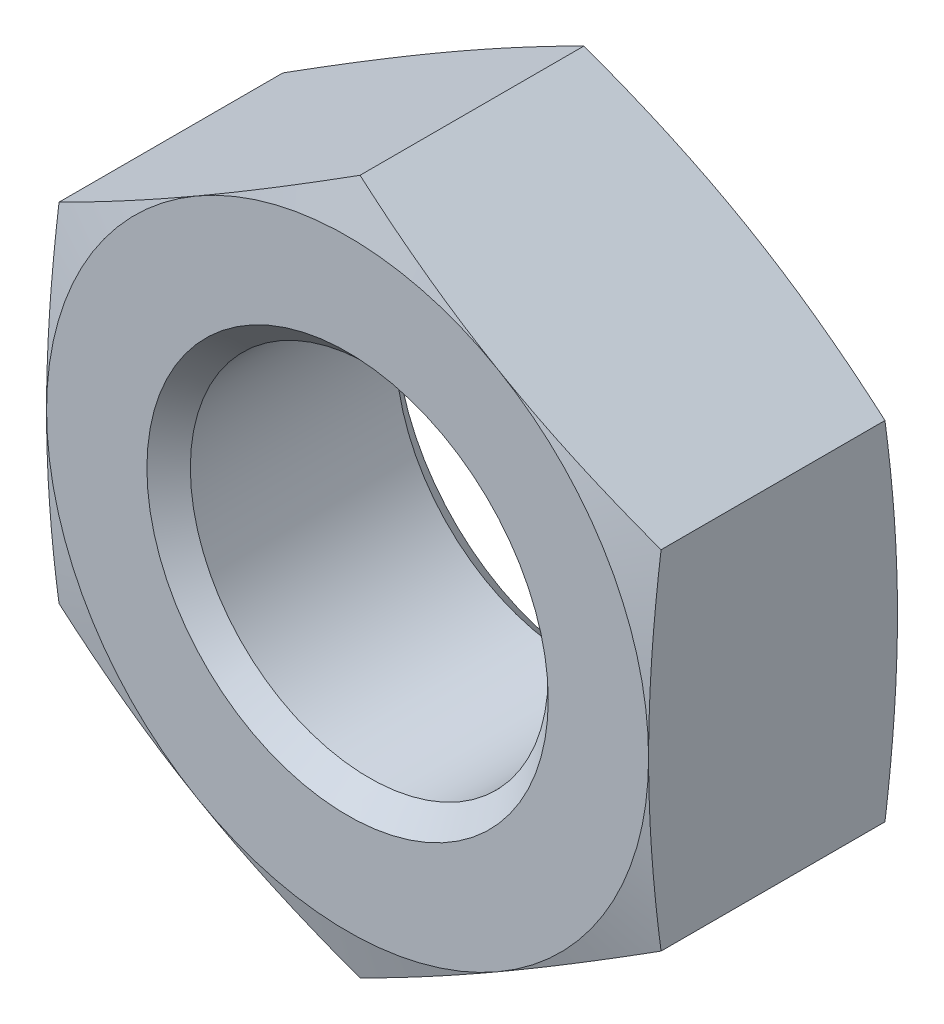
ISO-10303-21;
HEADER;
FILE_DESCRIPTION(('STEP AP214'),'2;1');
FILE_NAME('part.step','',(''),(''),'','','');
FILE_SCHEMA(('AUTOMOTIVE_DESIGN { 1 0 10303 214 1 1 1 1 }'));
ENDSEC;
DATA;
#1=APPLICATION_CONTEXT('core data for automotive mechanical design processes');
#2=APPLICATION_PROTOCOL_DEFINITION('international standard','automotive_design',2000,#1);
#3=PRODUCT_CONTEXT('',#1,'mechanical');
#4=PRODUCT('Part','Part','',(#3));
#5=PRODUCT_RELATED_PRODUCT_CATEGORY('part','',(#4));
#6=PRODUCT_DEFINITION_FORMATION('','',#4);
#7=PRODUCT_DEFINITION_CONTEXT('part definition',#1,'design');
#8=PRODUCT_DEFINITION('design','',#6,#7);
#9=PRODUCT_DEFINITION_SHAPE('','',#8);
#10=(LENGTH_UNIT() NAMED_UNIT(*) SI_UNIT(.MILLI.,.METRE.));
#11=(NAMED_UNIT(*) PLANE_ANGLE_UNIT() SI_UNIT($,.RADIAN.));
#12=(NAMED_UNIT(*) SI_UNIT($,.STERADIAN.) SOLID_ANGLE_UNIT());
#13=UNCERTAINTY_MEASURE_WITH_UNIT(LENGTH_MEASURE(1.E-05),#10,'distance_accuracy_value','');
#14=(GEOMETRIC_REPRESENTATION_CONTEXT(3) GLOBAL_UNCERTAINTY_ASSIGNED_CONTEXT((#13)) GLOBAL_UNIT_ASSIGNED_CONTEXT((#10,
#11,#12)) REPRESENTATION_CONTEXT('',''));
#15=CARTESIAN_POINT('',(0.,0.,0.));
#16=DIRECTION('',(0.,0.,1.));
#17=DIRECTION('',(1.,0.,0.));
#18=AXIS2_PLACEMENT_3D('',#15,#16,#17);
#19=CARTESIAN_POINT('',(0.,0.,0.));
#20=DIRECTION('',(0.,0.,-1.));
#21=DIRECTION('',(-1.,0.,0.));
#22=AXIS2_PLACEMENT_3D('',#19,#20,#21);
#23=PLANE('',#22);
#24=CARTESIAN_POINT('',(0.,0.,0.));
#25=DIRECTION('',(0.,0.,1.));
#26=DIRECTION('',(1.,0.,0.));
#27=AXIS2_PLACEMENT_3D('',#24,#25,#26);
#28=CIRCLE('',#27,9.525);
#29=CARTESIAN_POINT('',(9.525,0.,0.));
#30=VERTEX_POINT('',#29);
#31=CARTESIAN_POINT('',(4.76249999999967,8.24889197104679,0.));
#32=VERTEX_POINT('',#31);
#33=EDGE_CURVE('E11',#30,#32,#28,.T.);
#34=ORIENTED_EDGE('',*,*,#33,.T.);
#35=CARTESIAN_POINT('',(-4.76249999999967,8.24889197104679,0.));
#36=VERTEX_POINT('',#35);
#37=EDGE_CURVE('E43',#32,#36,#28,.T.);
#38=ORIENTED_EDGE('',*,*,#37,.T.);
#39=CARTESIAN_POINT('',(-9.525,0.,0.));
#40=VERTEX_POINT('',#39);
#41=EDGE_CURVE('E328',#36,#40,#28,.T.);
#42=ORIENTED_EDGE('',*,*,#41,.T.);
#43=CARTESIAN_POINT('',(-4.76249999999967,-8.24889197104679,0.));
#44=VERTEX_POINT('',#43);
#45=EDGE_CURVE('E321',#40,#44,#28,.T.);
#46=ORIENTED_EDGE('',*,*,#45,.T.);
#47=CARTESIAN_POINT('',(4.76249999999967,-8.24889197104679,0.));
#48=VERTEX_POINT('',#47);
#49=EDGE_CURVE('E324',#44,#48,#28,.T.);
#50=ORIENTED_EDGE('',*,*,#49,.T.);
#51=EDGE_CURVE('E44',#48,#30,#28,.T.);
#52=ORIENTED_EDGE('',*,*,#51,.T.);
#53=EDGE_LOOP('',(#34,#38,#42,#46,#50,#52));
#54=FACE_BOUND('',#53,.T.);
#55=CARTESIAN_POINT('',(0.,0.,0.));
#56=DIRECTION('',(0.,0.,1.));
#57=DIRECTION('',(1.,0.,0.));
#58=AXIS2_PLACEMENT_3D('',#55,#56,#57);
#59=CIRCLE('',#58,6.35);
#60=CARTESIAN_POINT('',(6.35,0.,0.));
#61=VERTEX_POINT('',#60);
#62=EDGE_CURVE('E185',#61,#61,#59,.T.);
#63=ORIENTED_EDGE('',*,*,#62,.F.);
#64=EDGE_LOOP('',(#63));
#65=FACE_BOUND('',#64,.T.);
#66=ADVANCED_FACE('F36',(#54,#65),#23,.F.);
#67=CARTESIAN_POINT('',(0.,9.525,-7.874));
#68=DIRECTION('',(0.,0.,1.));
#69=DIRECTION('',(1.,0.,0.));
#70=AXIS2_PLACEMENT_3D('',#67,#68,#69);
#71=PLANE('',#70);
#72=CARTESIAN_POINT('',(0.,0.,-7.874));
#73=DIRECTION('',(0.,0.,1.));
#74=DIRECTION('',(1.,0.,0.));
#75=AXIS2_PLACEMENT_3D('',#72,#73,#74);
#76=CIRCLE('',#75,9.525);
#77=CARTESIAN_POINT('',(9.525,0.,-7.874));
#78=VERTEX_POINT('',#77);
#79=CARTESIAN_POINT('',(4.76249999999967,8.24889197104679,-7.874));
#80=VERTEX_POINT('',#79);
#81=EDGE_CURVE('E359',#78,#80,#76,.T.);
#82=ORIENTED_EDGE('',*,*,#81,.F.);
#83=CARTESIAN_POINT('',(4.76249999999967,-8.24889197104679,-7.874));
#84=VERTEX_POINT('',#83);
#85=EDGE_CURVE('E362',#84,#78,#76,.T.);
#86=ORIENTED_EDGE('',*,*,#85,.F.);
#87=CARTESIAN_POINT('',(-4.76249999999967,-8.24889197104679,-7.874));
#88=VERTEX_POINT('',#87);
#89=EDGE_CURVE('E363',#88,#84,#76,.T.);
#90=ORIENTED_EDGE('',*,*,#89,.F.);
#91=CARTESIAN_POINT('',(-9.525,0.,-7.874));
#92=VERTEX_POINT('',#91);
#93=EDGE_CURVE('E143',#92,#88,#76,.T.);
#94=ORIENTED_EDGE('',*,*,#93,.F.);
#95=CARTESIAN_POINT('',(-4.76249999999967,8.24889197104679,-7.874));
#96=VERTEX_POINT('',#95);
#97=EDGE_CURVE('E360',#96,#92,#76,.T.);
#98=ORIENTED_EDGE('',*,*,#97,.F.);
#99=EDGE_CURVE('E356',#80,#96,#76,.T.);
#100=ORIENTED_EDGE('',*,*,#99,.F.);
#101=EDGE_LOOP('',(#82,#86,#90,#94,#98,#100));
#102=FACE_BOUND('',#101,.T.);
#103=CARTESIAN_POINT('',(0.,0.,-7.874));
#104=DIRECTION('',(0.,0.,1.));
#105=DIRECTION('',(1.,0.,0.));
#106=AXIS2_PLACEMENT_3D('',#103,#104,#105);
#107=CIRCLE('',#106,6.35);
#108=CARTESIAN_POINT('',(6.35,0.,-7.874));
#109=VERTEX_POINT('',#108);
#110=EDGE_CURVE('E205',#109,#109,#107,.T.);
#111=ORIENTED_EDGE('',*,*,#110,.T.);
#112=EDGE_LOOP('',(#111));
#113=FACE_BOUND('',#112,.T.);
#114=ADVANCED_FACE('F209',(#102,#113),#71,.F.);
#115=CARTESIAN_POINT('',(0.,0.,-0.51044321158129));
#116=DIRECTION('',(0.,0.,-1.));
#117=DIRECTION('',(-1.,0.,0.));
#118=AXIS2_PLACEMENT_3D('',#115,#116,#117);
#119=CONICAL_SURFACE('',#118,11.43,1.30899693899575);
#120=CARTESIAN_POINT('',(-9.5252,5.49914584397736,-0.394860138813217));
#121=CARTESIAN_POINT('',(-9.12963409059495,5.72752592825459,-0.333640796682183));
#122=CARTESIAN_POINT('',(-8.73335098645959,5.95632008510242,-0.278063785000044));
#123=CARTESIAN_POINT('',(-7.93938530731218,6.41471638368547,-0.180420245700739));
#124=CARTESIAN_POINT('',(-7.54170222999413,6.64431881542719,-0.138359205490608));
#125=CARTESIAN_POINT('',(-6.74734769859133,7.10293961796456,-0.0702030508394436));
#126=CARTESIAN_POINT('',(-6.35068161565081,7.33195488772865,-0.0440266592177038));
#127=CARTESIAN_POINT('',(-5.55684361330912,7.79027747207355,-0.00892680272709887));
#128=CARTESIAN_POINT('',(-5.15967180665456,8.01958472156008,0.));
#129=CARTESIAN_POINT('',(-4.36532819334544,8.47819922053312,0.));
#130=CARTESIAN_POINT('',(-3.96815638669089,8.70750647001964,-0.00892680272707922));
#131=CARTESIAN_POINT('',(-3.1743183843492,9.16582905436454,-0.0440266592176653));
#132=CARTESIAN_POINT('',(-2.77765230140867,9.39484432412863,-0.0702030508393962));
#133=CARTESIAN_POINT('',(-1.98329777000587,9.85346512666601,-0.138359205490543));
#134=CARTESIAN_POINT('',(-1.58561469268782,10.0830675584077,-0.180420245700665));
#135=CARTESIAN_POINT('',(-0.791649013540406,10.5414638569908,-0.278063784999956));
#136=CARTESIAN_POINT('',(-0.395365909405051,10.7702580138386,-0.333640796682088));
#137=CARTESIAN_POINT('',(0.000200000000002884,10.9986380981158,-0.394860138813116));
#138=B_SPLINE_CURVE_WITH_KNOTS('',3,(#120,#121,#122,#123,#124,#125,#126,#127,#128,#129,#130,
#131,#132,#133,#134,#135,#136,#137),.UNSPECIFIED.,.F.,.F.,(4,2,2,2,2,2,2,2,4),(0.,
1.38260595399383,2.76577253095806,4.14180081922071,5.51756281432405,6.89332480942739,
8.26935309769005,9.65251967465428,11.0351256286481),.UNSPECIFIED.);
#139=CARTESIAN_POINT('',(-9.525,5.4992613140312,-0.394829198218301));
#140=VERTEX_POINT('',#139);
#141=EDGE_CURVE('E336',#140,#36,#138,.T.);
#142=ORIENTED_EDGE('',*,*,#141,.F.);
#143=CARTESIAN_POINT('',(-9.525,-14.5475764020868,-2.10700053733457));
#144=CARTESIAN_POINT('',(-9.525,-14.1154545272533,-2.01015665380227));
#145=CARTESIAN_POINT('',(-9.525,-13.6830623737584,-1.91449717538181));
#146=CARTESIAN_POINT('',(-9.525,-12.8176047718722,-1.72618634166031));
#147=CARTESIAN_POINT('',(-9.525,-12.3845392952461,-1.63353511627697));
#148=CARTESIAN_POINT('',(-9.525,-11.5172143724825,-1.45179947328317));
#149=CARTESIAN_POINT('',(-9.525,-11.0829541718439,-1.36271864368223));
#150=CARTESIAN_POINT('',(-9.525,-10.2135298995259,-1.18908532307698));
#151=CARTESIAN_POINT('',(-9.525,-9.77836583550729,-1.10453279385442));
#152=CARTESIAN_POINT('',(-9.525,-8.91045271387352,-0.941687070782559));
#153=CARTESIAN_POINT('',(-9.525,-8.47771204984104,-0.863349361783966));
#154=CARTESIAN_POINT('',(-9.525,-7.61103920723077,-0.713511175498409));
#155=CARTESIAN_POINT('',(-9.525,-7.17710702423409,-0.642010723603448));
#156=CARTESIAN_POINT('',(-9.525,-6.3079835787254,-0.507460134682709));
#157=CARTESIAN_POINT('',(-9.525,-5.87279249560451,-0.444408848938874));
#158=CARTESIAN_POINT('',(-9.525,-5.00102546538243,-0.328613528609522));
#159=CARTESIAN_POINT('',(-9.525,-4.56444951698422,-0.275869503680421));
#160=CARTESIAN_POINT('',(-9.525,-3.68498736907801,-0.182182226479484));
#161=CARTESIAN_POINT('',(-9.525,-3.24208590614391,-0.141380128858051));
#162=CARTESIAN_POINT('',(-9.525,-2.3551695192014,-0.0743914625047044));
#163=CARTESIAN_POINT('',(-9.525,-1.91115462096316,-0.0482045585876714));
#164=CARTESIAN_POINT('',(-9.525,-1.02265544778738,-0.0119736055530143));
#165=CARTESIAN_POINT('',(-9.525,-0.578171478140084,-0.00192222051875414));
#166=CARTESIAN_POINT('',(-9.525,0.310860382292135,0.0014197158828076));
#167=CARTESIAN_POINT('',(-9.525,0.755408273021624,-0.00528971830137563));
#168=CARTESIAN_POINT('',(-9.525,1.64556100156032,-0.0350921058062273));
#169=CARTESIAN_POINT('',(-9.525,2.09116380788821,-0.05824452135586));
#170=CARTESIAN_POINT('',(-9.525,2.98132146724324,-0.119611293454157));
#171=CARTESIAN_POINT('',(-9.525,3.42587629685002,-0.157825983466163));
#172=CARTESIAN_POINT('',(-9.525,4.31393426073179,-0.247386972149112));
#173=CARTESIAN_POINT('',(-9.525,4.75743651730109,-0.298741840574358));
#174=CARTESIAN_POINT('',(-9.525,5.64301373388866,-0.412446238030744));
#175=CARTESIAN_POINT('',(-9.525,6.08508868942129,-0.474795801581269));
#176=CARTESIAN_POINT('',(-9.525,6.93863059078922,-0.60406870466817));
#177=CARTESIAN_POINT('',(-9.525,7.35018571786526,-0.670415694558651));
#178=CARTESIAN_POINT('',(-9.525,8.1722113347349,-0.809549374135356));
#179=CARTESIAN_POINT('',(-9.525,8.58268179462157,-0.88233623951543));
#180=CARTESIAN_POINT('',(-9.525,9.40269226744411,-1.03317413364716));
#181=CARTESIAN_POINT('',(-9.525,9.81223218249156,-1.11122569191772));
#182=CARTESIAN_POINT('',(-9.525,10.6304633616968,-1.2716227533516));
#183=CARTESIAN_POINT('',(-9.525,11.0391546334989,-1.35396821766051));
#184=CARTESIAN_POINT('',(-9.525,11.8559072643163,-1.52219707925344));
#185=CARTESIAN_POINT('',(-9.525,12.263968451238,-1.60808130975762));
#186=CARTESIAN_POINT('',(-9.525,13.0794697353503,-1.78275374718487));
#187=CARTESIAN_POINT('',(-9.525,13.4869098289146,-1.87154197099536));
#188=CARTESIAN_POINT('',(-9.525,14.7083824724732,-2.141478979871));
#189=CARTESIAN_POINT('',(-9.525,15.5216227029363,-2.32621164794026));
#190=CARTESIAN_POINT('',(-9.525,17.1385663316362,-2.70049505968895));
#191=CARTESIAN_POINT('',(-9.525,17.9422849173435,-2.88998062119992));
#192=CARTESIAN_POINT('',(-9.525,19.5486013702555,-3.27370003667641));
#193=CARTESIAN_POINT('',(-9.525,20.3511992167613,-3.46793397714473));
#194=CARTESIAN_POINT('',(-9.525,21.9545467971208,-3.85966403393681));
#195=CARTESIAN_POINT('',(-9.525,22.7552975893812,-4.05715582886057));
#196=CARTESIAN_POINT('',(-9.525,24.3561016695518,-4.45483612957746));
#197=CARTESIAN_POINT('',(-9.525,25.1561549796084,-4.65502454616131));
#198=CARTESIAN_POINT('',(-9.525,25.9559652614663,-4.85616849306163));
#199=B_SPLINE_CURVE_WITH_KNOTS('',3,(#143,#144,#145,#146,#147,#148,#149,#150,#151,#152,#153,
#154,#155,#156,#157,#158,#159,#160,#161,#162,#163,#164,#165,#166,#167,#168,#169,#170,#171,#172,
#173,#174,#175,#176,#177,#178,#179,#180,#181,#182,#183,#184,#185,#186,#187,#188,#189,#190,#191,
#192,#193,#194,#195,#196,#197,#198),.UNSPECIFIED.,.F.,.F.,(4,2,2,2,2,2,2,2,2,2,2,2,2,2,2,2,2,2,
2,2,2,2,2,2,2,2,2,4),(0.,1.32852807234632,2.65711344384133,3.9870020892345,5.31687950877447,
6.63615804920664,7.9554414889461,9.27454538131036,10.5936505094786,11.9277702270627,
13.2618593466634,14.5953417587129,15.9288230212463,17.2671512261352,18.6055090619053,
19.944741981874,21.2839791066269,22.5345250760034,23.7851051735283,25.0358112415721,
26.2865059942705,27.5374969311748,28.7884951441869,31.2903220535286,33.7675648960264,
36.2448529009587,38.7190838635641,41.1932331740361),.UNSPECIFIED.);
#200=EDGE_CURVE('E154',#40,#140,#199,.T.);
#201=ORIENTED_EDGE('',*,*,#200,.F.);
#202=ORIENTED_EDGE('',*,*,#41,.F.);
#203=EDGE_LOOP('',(#142,#201,#202));
#204=FACE_BOUND('',#203,.T.);
#205=ADVANCED_FACE('F227',(#204),#119,.T.);
#206=CARTESIAN_POINT('',(0.,10.998522628062,-0.3948291982182));
#207=VERTEX_POINT('',#206);
#208=EDGE_CURVE('E333',#36,#207,#138,.T.);
#209=ORIENTED_EDGE('',*,*,#208,.F.);
#210=ORIENTED_EDGE('',*,*,#37,.F.);
#211=CARTESIAN_POINT('',(-0.0002,10.9986380981158,-0.394860138813116));
#212=CARTESIAN_POINT('',(0.395365909405055,10.7702580138386,-0.333640796682088));
#213=CARTESIAN_POINT('',(0.791649013540409,10.5414638569908,-0.278063784999956));
#214=CARTESIAN_POINT('',(1.58561469268782,10.0830675584077,-0.180420245700666));
#215=CARTESIAN_POINT('',(1.98329777000587,9.85346512666601,-0.138359205490543));
#216=CARTESIAN_POINT('',(2.77765230140867,9.39484432412863,-0.0702030508393961));
#217=CARTESIAN_POINT('',(3.1743183843492,9.16582905436454,-0.0440266592176652));
#218=CARTESIAN_POINT('',(3.96815638669089,8.70750647001964,-0.0089268027270791));
#219=CARTESIAN_POINT('',(4.36532819334545,8.47819922053312,0.));
#220=CARTESIAN_POINT('',(5.15967180665456,8.01958472156008,0.));
#221=CARTESIAN_POINT('',(5.55684361330912,7.79027747207355,-0.0089268027270988));
#222=CARTESIAN_POINT('',(6.35068161565081,7.33195488772866,-0.044026659217704));
#223=CARTESIAN_POINT('',(6.74734769859133,7.10293961796456,-0.0702030508394441));
#224=CARTESIAN_POINT('',(7.54170222999413,6.64431881542719,-0.138359205490608));
#225=CARTESIAN_POINT('',(7.93938530731218,6.41471638368547,-0.180420245700739));
#226=CARTESIAN_POINT('',(8.73335098645959,5.95632008510242,-0.278063785000044));
#227=CARTESIAN_POINT('',(9.12963409059495,5.72752592825459,-0.333640796682183));
#228=CARTESIAN_POINT('',(9.5252,5.49914584397736,-0.394860138813218));
#229=B_SPLINE_CURVE_WITH_KNOTS('',3,(#211,#212,#213,#214,#215,#216,#217,#218,#219,#220,#221,
#222,#223,#224,#225,#226,#227,#228),.UNSPECIFIED.,.F.,.F.,(4,2,2,2,2,2,2,2,4),(0.,
1.38260595399383,2.76577253095806,4.14180081922071,5.51756281432405,6.89332480942739,
8.26935309769005,9.65251967465428,11.0351256286481),.UNSPECIFIED.);
#230=EDGE_CURVE('E266',#207,#32,#229,.T.);
#231=ORIENTED_EDGE('',*,*,#230,.F.);
#232=EDGE_LOOP('',(#209,#210,#231));
#233=FACE_BOUND('',#232,.T.);
#234=ADVANCED_FACE('F275',(#233),#119,.T.);
#235=CARTESIAN_POINT('',(9.525,5.4992613140312,-0.394829198218301));
#236=VERTEX_POINT('',#235);
#237=EDGE_CURVE('E261',#32,#236,#229,.T.);
#238=ORIENTED_EDGE('',*,*,#237,.F.);
#239=ORIENTED_EDGE('',*,*,#33,.F.);
#240=CARTESIAN_POINT('',(9.525,-14.5475764020868,-2.10700053733457));
#241=CARTESIAN_POINT('',(9.525,-14.1154545272533,-2.01015665380227));
#242=CARTESIAN_POINT('',(9.525,-13.6830623737584,-1.91449717538181));
#243=CARTESIAN_POINT('',(9.525,-12.8176047718722,-1.72618634166031));
#244=CARTESIAN_POINT('',(9.525,-12.3845392952461,-1.63353511627697));
#245=CARTESIAN_POINT('',(9.525,-11.5172143724825,-1.45179947328317));
#246=CARTESIAN_POINT('',(9.525,-11.0829541718439,-1.36271864368223));
#247=CARTESIAN_POINT('',(9.525,-10.2135298995259,-1.18908532307698));
#248=CARTESIAN_POINT('',(9.525,-9.77836583550729,-1.10453279385442));
#249=CARTESIAN_POINT('',(9.525,-8.91045271387352,-0.941687070782559));
#250=CARTESIAN_POINT('',(9.525,-8.47771204984104,-0.863349361783966));
#251=CARTESIAN_POINT('',(9.525,-7.61103920723077,-0.713511175498409));
#252=CARTESIAN_POINT('',(9.525,-7.17710702423409,-0.642010723603448));
#253=CARTESIAN_POINT('',(9.525,-6.3079835787254,-0.507460134682709));
#254=CARTESIAN_POINT('',(9.525,-5.87279249560451,-0.444408848938874));
#255=CARTESIAN_POINT('',(9.525,-5.00102546538243,-0.328613528609522));
#256=CARTESIAN_POINT('',(9.525,-4.56444951698422,-0.275869503680421));
#257=CARTESIAN_POINT('',(9.525,-3.68498736907801,-0.182182226479484));
#258=CARTESIAN_POINT('',(9.525,-3.24208590614391,-0.141380128858051));
#259=CARTESIAN_POINT('',(9.525,-2.3551695192014,-0.0743914625047044));
#260=CARTESIAN_POINT('',(9.525,-1.91115462096316,-0.0482045585876714));
#261=CARTESIAN_POINT('',(9.525,-1.02265544778738,-0.0119736055530143));
#262=CARTESIAN_POINT('',(9.525,-0.578171478140084,-0.00192222051875414));
#263=CARTESIAN_POINT('',(9.525,0.310860382292135,0.0014197158828076));
#264=CARTESIAN_POINT('',(9.525,0.755408273021624,-0.00528971830137563));
#265=CARTESIAN_POINT('',(9.525,1.64556100156032,-0.0350921058062273));
#266=CARTESIAN_POINT('',(9.525,2.09116380788821,-0.05824452135586));
#267=CARTESIAN_POINT('',(9.525,2.98132146724324,-0.119611293454157));
#268=CARTESIAN_POINT('',(9.525,3.42587629685002,-0.157825983466163));
#269=CARTESIAN_POINT('',(9.525,4.31393426073179,-0.247386972149112));
#270=CARTESIAN_POINT('',(9.525,4.75743651730109,-0.298741840574358));
#271=CARTESIAN_POINT('',(9.525,5.64301373388866,-0.412446238030744));
#272=CARTESIAN_POINT('',(9.525,6.08508868942129,-0.474795801581269));
#273=CARTESIAN_POINT('',(9.525,6.93863059078922,-0.60406870466817));
#274=CARTESIAN_POINT('',(9.525,7.35018571786526,-0.670415694558651));
#275=CARTESIAN_POINT('',(9.525,8.1722113347349,-0.809549374135356));
#276=CARTESIAN_POINT('',(9.525,8.58268179462157,-0.88233623951543));
#277=CARTESIAN_POINT('',(9.525,9.40269226744411,-1.03317413364716));
#278=CARTESIAN_POINT('',(9.525,9.81223218249156,-1.11122569191772));
#279=CARTESIAN_POINT('',(9.525,10.6304633616968,-1.2716227533516));
#280=CARTESIAN_POINT('',(9.525,11.0391546334989,-1.35396821766051));
#281=CARTESIAN_POINT('',(9.525,11.8559072643163,-1.52219707925344));
#282=CARTESIAN_POINT('',(9.525,12.263968451238,-1.60808130975762));
#283=CARTESIAN_POINT('',(9.525,13.0794697353503,-1.78275374718487));
#284=CARTESIAN_POINT('',(9.525,13.4869098289146,-1.87154197099536));
#285=CARTESIAN_POINT('',(9.525,14.7083824724732,-2.141478979871));
#286=CARTESIAN_POINT('',(9.525,15.5216227029363,-2.32621164794026));
#287=CARTESIAN_POINT('',(9.525,17.1385663316362,-2.70049505968895));
#288=CARTESIAN_POINT('',(9.525,17.9422849173435,-2.88998062119992));
#289=CARTESIAN_POINT('',(9.525,19.5486013702555,-3.27370003667641));
#290=CARTESIAN_POINT('',(9.525,20.3511992167613,-3.46793397714473));
#291=CARTESIAN_POINT('',(9.525,21.9545467971208,-3.85966403393681));
#292=CARTESIAN_POINT('',(9.525,22.7552975893812,-4.05715582886057));
#293=CARTESIAN_POINT('',(9.525,24.3561016695518,-4.45483612957746));
#294=CARTESIAN_POINT('',(9.525,25.1561549796084,-4.65502454616131));
#295=CARTESIAN_POINT('',(9.525,25.9559652614663,-4.85616849306163));
#296=B_SPLINE_CURVE_WITH_KNOTS('',3,(#240,#241,#242,#243,#244,#245,#246,#247,#248,#249,#250,
#251,#252,#253,#254,#255,#256,#257,#258,#259,#260,#261,#262,#263,#264,#265,#266,#267,#268,#269,
#270,#271,#272,#273,#274,#275,#276,#277,#278,#279,#280,#281,#282,#283,#284,#285,#286,#287,#288,
#289,#290,#291,#292,#293,#294,#295),.UNSPECIFIED.,.F.,.F.,(4,2,2,2,2,2,2,2,2,2,2,2,2,2,2,2,2,2,
2,2,2,2,2,2,2,2,2,4),(0.,1.32852807234632,2.65711344384133,3.9870020892345,5.31687950877447,
6.63615804920664,7.9554414889461,9.27454538131036,10.5936505094786,11.9277702270627,
13.2618593466634,14.5953417587129,15.9288230212463,17.2671512261352,18.6055090619053,
19.944741981874,21.2839791066269,22.5345250760034,23.7851051735283,25.0358112415721,
26.2865059942705,27.5374969311748,28.7884951441869,31.2903220535286,33.7675648960264,
36.2448529009587,38.7190838635641,41.1932331740361),.UNSPECIFIED.);
#297=EDGE_CURVE('E293',#236,#30,#296,.F.);
#298=ORIENTED_EDGE('',*,*,#297,.F.);
#299=EDGE_LOOP('',(#238,#239,#298));
#300=FACE_BOUND('',#299,.T.);
#301=ADVANCED_FACE('F347',(#300),#119,.T.);
#302=CARTESIAN_POINT('',(9.525,-5.4992613140312,-0.394829198218301));
#303=VERTEX_POINT('',#302);
#304=EDGE_CURVE('E289',#30,#303,#296,.F.);
#305=ORIENTED_EDGE('',*,*,#304,.F.);
#306=ORIENTED_EDGE('',*,*,#51,.F.);
#307=CARTESIAN_POINT('',(9.5252,-5.49914584397736,-0.394860138813217));
#308=CARTESIAN_POINT('',(9.12963409059495,-5.72752592825459,-0.333640796682183));
#309=CARTESIAN_POINT('',(8.73335098645959,-5.95632008510242,-0.278063785000044));
#310=CARTESIAN_POINT('',(7.93938530731218,-6.41471638368547,-0.180420245700739));
#311=CARTESIAN_POINT('',(7.54170222999413,-6.64431881542719,-0.138359205490608));
#312=CARTESIAN_POINT('',(6.74734769859133,-7.10293961796456,-0.0702030508394436));
#313=CARTESIAN_POINT('',(6.35068161565081,-7.33195488772865,-0.0440266592177038));
#314=CARTESIAN_POINT('',(5.55684361330912,-7.79027747207355,-0.00892680272709887));
#315=CARTESIAN_POINT('',(5.15967180665456,-8.01958472156008,0.));
#316=CARTESIAN_POINT('',(4.36532819334544,-8.47819922053312,0.));
#317=CARTESIAN_POINT('',(3.96815638669089,-8.70750647001964,-0.00892680272707922));
#318=CARTESIAN_POINT('',(3.1743183843492,-9.16582905436454,-0.0440266592176653));
#319=CARTESIAN_POINT('',(2.77765230140867,-9.39484432412863,-0.0702030508393962));
#320=CARTESIAN_POINT('',(1.98329777000587,-9.85346512666601,-0.138359205490543));
#321=CARTESIAN_POINT('',(1.58561469268782,-10.0830675584077,-0.180420245700665));
#322=CARTESIAN_POINT('',(0.791649013540406,-10.5414638569908,-0.278063784999956));
#323=CARTESIAN_POINT('',(0.395365909405051,-10.7702580138386,-0.333640796682088));
#324=CARTESIAN_POINT('',(-0.000200000000002884,-10.9986380981158,-0.394860138813116));
#325=B_SPLINE_CURVE_WITH_KNOTS('',3,(#307,#308,#309,#310,#311,#312,#313,#314,#315,#316,#317,
#318,#319,#320,#321,#322,#323,#324),.UNSPECIFIED.,.F.,.F.,(4,2,2,2,2,2,2,2,4),(0.,
1.38260595399383,2.76577253095806,4.14180081922071,5.51756281432405,6.89332480942739,
8.26935309769005,9.65251967465428,11.0351256286481),.UNSPECIFIED.);
#326=EDGE_CURVE('E299',#303,#48,#325,.T.);
#327=ORIENTED_EDGE('',*,*,#326,.F.);
#328=EDGE_LOOP('',(#305,#306,#327));
#329=FACE_BOUND('',#328,.T.);
#330=ADVANCED_FACE('F387',(#329),#119,.T.);
#331=CARTESIAN_POINT('',(0.,-10.998522628062,-0.3948291982182));
#332=VERTEX_POINT('',#331);
#333=EDGE_CURVE('E284',#48,#332,#325,.T.);
#334=ORIENTED_EDGE('',*,*,#333,.F.);
#335=ORIENTED_EDGE('',*,*,#49,.F.);
#336=CARTESIAN_POINT('',(0.0002,-10.9986380981158,-0.394860138813116));
#337=CARTESIAN_POINT('',(-0.395365909405055,-10.7702580138386,-0.333640796682088));
#338=CARTESIAN_POINT('',(-0.791649013540409,-10.5414638569908,-0.278063784999956));
#339=CARTESIAN_POINT('',(-1.58561469268782,-10.0830675584077,-0.180420245700666));
#340=CARTESIAN_POINT('',(-1.98329777000587,-9.85346512666601,-0.138359205490543));
#341=CARTESIAN_POINT('',(-2.77765230140867,-9.39484432412863,-0.0702030508393961));
#342=CARTESIAN_POINT('',(-3.1743183843492,-9.16582905436454,-0.0440266592176652));
#343=CARTESIAN_POINT('',(-3.96815638669089,-8.70750647001964,-0.0089268027270791));
#344=CARTESIAN_POINT('',(-4.36532819334545,-8.47819922053312,0.));
#345=CARTESIAN_POINT('',(-5.15967180665456,-8.01958472156008,0.));
#346=CARTESIAN_POINT('',(-5.55684361330912,-7.79027747207355,-0.0089268027270988));
#347=CARTESIAN_POINT('',(-6.35068161565081,-7.33195488772866,-0.044026659217704));
#348=CARTESIAN_POINT('',(-6.74734769859133,-7.10293961796456,-0.0702030508394441));
#349=CARTESIAN_POINT('',(-7.54170222999413,-6.64431881542719,-0.138359205490608));
#350=CARTESIAN_POINT('',(-7.93938530731218,-6.41471638368547,-0.180420245700739));
#351=CARTESIAN_POINT('',(-8.73335098645959,-5.95632008510242,-0.278063785000044));
#352=CARTESIAN_POINT('',(-9.12963409059495,-5.72752592825459,-0.333640796682183));
#353=CARTESIAN_POINT('',(-9.5252,-5.49914584397736,-0.394860138813218));
#354=B_SPLINE_CURVE_WITH_KNOTS('',3,(#336,#337,#338,#339,#340,#341,#342,#343,#344,#345,#346,
#347,#348,#349,#350,#351,#352,#353),.UNSPECIFIED.,.F.,.F.,(4,2,2,2,2,2,2,2,4),(0.,
1.38260595399383,2.76577253095806,4.14180081922071,5.51756281432405,6.89332480942739,
8.26935309769005,9.65251967465428,11.0351256286481),.UNSPECIFIED.);
#355=EDGE_CURVE('E146',#332,#44,#354,.T.);
#356=ORIENTED_EDGE('',*,*,#355,.F.);
#357=EDGE_LOOP('',(#334,#335,#356));
#358=FACE_BOUND('',#357,.T.);
#359=ADVANCED_FACE('F325',(#358),#119,.T.);
#360=CARTESIAN_POINT('',(-9.525,-5.4992613140312,-0.394829198218301));
#361=VERTEX_POINT('',#360);
#362=EDGE_CURVE('E138',#44,#361,#354,.T.);
#363=ORIENTED_EDGE('',*,*,#362,.F.);
#364=ORIENTED_EDGE('',*,*,#45,.F.);
#365=EDGE_CURVE('E51',#361,#40,#199,.T.);
#366=ORIENTED_EDGE('',*,*,#365,.F.);
#367=EDGE_LOOP('',(#363,#364,#366));
#368=FACE_BOUND('',#367,.T.);
#369=ADVANCED_FACE('F277',(#368),#119,.T.);
#370=CARTESIAN_POINT('',(0.,10.998522628062,-7.874));
#371=DIRECTION('',(-0.499999999999974,0.866025403784454,0.));
#372=DIRECTION('',(-0.866025403784454,-0.499999999999974,0.));
#373=AXIS2_PLACEMENT_3D('',#370,#371,#372);
#374=PLANE('',#373);
#375=ORIENTED_EDGE('',*,*,#141,.T.);
#376=ORIENTED_EDGE('',*,*,#208,.T.);
#377=DIRECTION('',(0.,0.,1.));
#378=VECTOR('',#377,1.);
#379=CARTESIAN_POINT('',(0.,10.998522628062,-7.874));
#380=LINE('',#379,#378);
#381=CARTESIAN_POINT('',(0.,10.998522628062,-7.47917080178179));
#382=VERTEX_POINT('',#381);
#383=EDGE_CURVE('E131',#382,#207,#380,.T.);
#384=ORIENTED_EDGE('',*,*,#383,.F.);
#385=CARTESIAN_POINT('',(0.000200000000000055,10.9986380981158,-7.47913986118688));
#386=CARTESIAN_POINT('',(-0.395365909405054,10.7702580138386,-7.54035920331791));
#387=CARTESIAN_POINT('',(-0.791649013540408,10.5414638569908,-7.59593621500004));
#388=CARTESIAN_POINT('',(-1.58561469268782,10.0830675584077,-7.69357975429933));
#389=CARTESIAN_POINT('',(-1.98329777000587,9.85346512666601,-7.73564079450945));
#390=CARTESIAN_POINT('',(-2.77765230140867,9.39484432412863,-7.8037969491606));
#391=CARTESIAN_POINT('',(-3.1743183843492,9.16582905436454,-7.82997334078233));
#392=CARTESIAN_POINT('',(-3.96815638669089,8.70750647001964,-7.86507319727292));
#393=CARTESIAN_POINT('',(-4.36532819334544,8.47819922053312,-7.87400000000005));
#394=CARTESIAN_POINT('',(-5.15967180665456,8.01958472156008,-7.87400000000004));
#395=CARTESIAN_POINT('',(-5.55684361330912,7.79027747207355,-7.8650731972729));
#396=CARTESIAN_POINT('',(-6.35068161565081,7.33195488772865,-7.82997334078229));
#397=CARTESIAN_POINT('',(-6.74734769859133,7.10293961796456,-7.80379694916055));
#398=CARTESIAN_POINT('',(-7.54170222999413,6.64431881542719,-7.73564079450939));
#399=CARTESIAN_POINT('',(-7.93938530731218,6.41471638368547,-7.69357975429926));
#400=CARTESIAN_POINT('',(-8.73335098645959,5.95632008510242,-7.59593621499995));
#401=CARTESIAN_POINT('',(-9.12963409059495,5.72752592825459,-7.54035920331781));
#402=CARTESIAN_POINT('',(-9.5252,5.49914584397736,-7.47913986118678));
#403=B_SPLINE_CURVE_WITH_KNOTS('',3,(#385,#386,#387,#388,#389,#390,#391,#392,#393,#394,#395,
#396,#397,#398,#399,#400,#401,#402),.UNSPECIFIED.,.F.,.F.,(4,2,2,2,2,2,2,2,4),(0.,
1.38260595399383,2.76577253095806,4.14180081922071,5.51756281432405,6.8933248094274,
8.26935309769005,9.65251967465427,11.0351256286481),.UNSPECIFIED.);
#404=EDGE_CURVE('E337',#382,#96,#403,.T.);
#405=ORIENTED_EDGE('',*,*,#404,.T.);
#406=CARTESIAN_POINT('',(-9.525,5.4992613140312,-7.47917080178169));
#407=VERTEX_POINT('',#406);
#408=EDGE_CURVE('E268',#96,#407,#403,.T.);
#409=ORIENTED_EDGE('',*,*,#408,.T.);
#410=DIRECTION('',(0.,0.,1.));
#411=VECTOR('',#410,1.);
#412=CARTESIAN_POINT('',(-9.525,5.4992613140312,-7.874));
#413=LINE('',#412,#411);
#414=EDGE_CURVE('E140',#407,#140,#413,.T.);
#415=ORIENTED_EDGE('',*,*,#414,.T.);
#416=EDGE_LOOP('',(#375,#376,#384,#405,#409,#415));
#417=FACE_BOUND('',#416,.T.);
#418=ADVANCED_FACE('F177',(#417),#374,.T.);
#419=CARTESIAN_POINT('',(9.525,5.4992613140312,-7.874));
#420=DIRECTION('',(0.499999999999974,0.866025403784454,0.));
#421=DIRECTION('',(-0.866025403784454,0.499999999999974,0.));
#422=AXIS2_PLACEMENT_3D('',#419,#420,#421);
#423=PLANE('',#422);
#424=ORIENTED_EDGE('',*,*,#230,.T.);
#425=ORIENTED_EDGE('',*,*,#237,.T.);
#426=DIRECTION('',(0.,0.,1.));
#427=VECTOR('',#426,1.);
#428=CARTESIAN_POINT('',(9.525,5.4992613140312,-7.874));
#429=LINE('',#428,#427);
#430=CARTESIAN_POINT('',(9.525,5.4992613140312,-7.47917080178169));
#431=VERTEX_POINT('',#430);
#432=EDGE_CURVE('E192',#431,#236,#429,.T.);
#433=ORIENTED_EDGE('',*,*,#432,.F.);
#434=CARTESIAN_POINT('',(9.5252,5.49914584397736,-7.47913986118678));
#435=CARTESIAN_POINT('',(9.12963409059495,5.72752592825459,-7.54035920331781));
#436=CARTESIAN_POINT('',(8.73335098645959,5.95632008510242,-7.59593621499995));
#437=CARTESIAN_POINT('',(7.93938530731218,6.41471638368547,-7.69357975429926));
#438=CARTESIAN_POINT('',(7.54170222999413,6.64431881542719,-7.73564079450939));
#439=CARTESIAN_POINT('',(6.74734769859133,7.10293961796456,-7.80379694916055));
#440=CARTESIAN_POINT('',(6.35068161565081,7.33195488772866,-7.82997334078229));
#441=CARTESIAN_POINT('',(5.55684361330912,7.79027747207355,-7.8650731972729));
#442=CARTESIAN_POINT('',(5.15967180665456,8.01958472156008,-7.87400000000004));
#443=CARTESIAN_POINT('',(4.36532819334545,8.47819922053312,-7.87400000000005));
#444=CARTESIAN_POINT('',(3.96815638669089,8.70750647001964,-7.86507319727292));
#445=CARTESIAN_POINT('',(3.1743183843492,9.16582905436454,-7.82997334078233));
#446=CARTESIAN_POINT('',(2.77765230140867,9.39484432412863,-7.8037969491606));
#447=CARTESIAN_POINT('',(1.98329777000587,9.85346512666601,-7.73564079450945));
#448=CARTESIAN_POINT('',(1.58561469268782,10.0830675584077,-7.69357975429933));
#449=CARTESIAN_POINT('',(0.791649013540409,10.5414638569908,-7.59593621500004));
#450=CARTESIAN_POINT('',(0.395365909405054,10.7702580138386,-7.54035920331791));
#451=CARTESIAN_POINT('',(-0.000199999999999537,10.9986380981158,-7.47913986118688));
#452=B_SPLINE_CURVE_WITH_KNOTS('',3,(#434,#435,#436,#437,#438,#439,#440,#441,#442,#443,#444,
#445,#446,#447,#448,#449,#450,#451),.UNSPECIFIED.,.F.,.F.,(4,2,2,2,2,2,2,2,4),(0.,
1.38260595399383,2.76577253095805,4.14180081922071,5.51756281432405,6.89332480942739,
8.26935309769005,9.65251967465427,11.0351256286481),.UNSPECIFIED.);
#453=EDGE_CURVE('E267',#431,#80,#452,.T.);
#454=ORIENTED_EDGE('',*,*,#453,.T.);
#455=EDGE_CURVE('E255',#80,#382,#452,.T.);
#456=ORIENTED_EDGE('',*,*,#455,.T.);
#457=ORIENTED_EDGE('',*,*,#383,.T.);
#458=EDGE_LOOP('',(#424,#425,#433,#454,#456,#457));
#459=FACE_BOUND('',#458,.T.);
#460=ADVANCED_FACE('F247',(#459),#423,.T.);
#461=CARTESIAN_POINT('',(9.525,-5.4992613140312,-7.874));
#462=DIRECTION('',(1.,0.,0.));
#463=DIRECTION('',(0.,0.,-1.));
#464=AXIS2_PLACEMENT_3D('',#461,#462,#463);
#465=PLANE('',#464);
#466=ORIENTED_EDGE('',*,*,#297,.T.);
#467=ORIENTED_EDGE('',*,*,#304,.T.);
#468=DIRECTION('',(0.,0.,1.));
#469=VECTOR('',#468,1.);
#470=CARTESIAN_POINT('',(9.525,-5.4992613140312,-7.874));
#471=LINE('',#470,#469);
#472=CARTESIAN_POINT('',(9.525,-5.4992613140312,-7.47917080178169));
#473=VERTEX_POINT('',#472);
#474=EDGE_CURVE('E189',#473,#303,#471,.T.);
#475=ORIENTED_EDGE('',*,*,#474,.F.);
#476=CARTESIAN_POINT('',(9.525,-14.5475764020868,-5.7669994626654));
#477=CARTESIAN_POINT('',(9.525,-14.1154545272533,-5.8638433461977));
#478=CARTESIAN_POINT('',(9.525,-13.6830623737584,-5.95950282461816));
#479=CARTESIAN_POINT('',(9.525,-12.8176047718722,-6.14781365833966));
#480=CARTESIAN_POINT('',(9.525,-12.3845392952461,-6.240464883723));
#481=CARTESIAN_POINT('',(9.525,-11.5172143724825,-6.4222005267168));
#482=CARTESIAN_POINT('',(9.525,-11.0829541718439,-6.51128135631775));
#483=CARTESIAN_POINT('',(9.525,-10.213529899526,-6.684914676923));
#484=CARTESIAN_POINT('',(9.525,-9.77836583550729,-6.76946720614556));
#485=CARTESIAN_POINT('',(9.525,-8.91045271387351,-6.93231292921742));
#486=CARTESIAN_POINT('',(9.525,-8.47771204984104,-7.01065063821602));
#487=CARTESIAN_POINT('',(9.525,-7.61103920723076,-7.16048882450158));
#488=CARTESIAN_POINT('',(9.525,-7.17710702423409,-7.23198927639654));
#489=CARTESIAN_POINT('',(9.525,-6.3079835787254,-7.36653986531728));
#490=CARTESIAN_POINT('',(9.525,-5.87279249560451,-7.42959115106112));
#491=CARTESIAN_POINT('',(9.525,-5.00102546538243,-7.54538647139047));
#492=CARTESIAN_POINT('',(9.525,-4.56444951698421,-7.59813049631957));
#493=CARTESIAN_POINT('',(9.525,-3.68498736907801,-7.69181777352051));
#494=CARTESIAN_POINT('',(9.525,-3.24208590614391,-7.73261987114195));
#495=CARTESIAN_POINT('',(9.525,-2.3551695192014,-7.79960853749529));
#496=CARTESIAN_POINT('',(9.525,-1.91115462096315,-7.82579544141233));
#497=CARTESIAN_POINT('',(9.525,-1.02265544778738,-7.86202639444698));
#498=CARTESIAN_POINT('',(9.525,-0.578171478140078,-7.87207777948124));
#499=CARTESIAN_POINT('',(9.525,0.310860382292142,-7.87541971588281));
#500=CARTESIAN_POINT('',(9.525,0.75540827302163,-7.86871028169862));
#501=CARTESIAN_POINT('',(9.525,1.64556100156032,-7.83890789419377));
#502=CARTESIAN_POINT('',(9.525,2.09116380788822,-7.81575547864414));
#503=CARTESIAN_POINT('',(9.525,2.98132146724324,-7.75438870654584));
#504=CARTESIAN_POINT('',(9.525,3.42587629685003,-7.71617401653383));
#505=CARTESIAN_POINT('',(9.525,4.3139342607318,-7.62661302785088));
#506=CARTESIAN_POINT('',(9.525,4.7574365173011,-7.57525815942563));
#507=CARTESIAN_POINT('',(9.525,5.64301373388868,-7.46155376196925));
#508=CARTESIAN_POINT('',(9.525,6.0850886894213,-7.39920419841872));
#509=CARTESIAN_POINT('',(9.525,6.93863059078923,-7.26993129533182));
#510=CARTESIAN_POINT('',(9.525,7.35018571786528,-7.20358430544133));
#511=CARTESIAN_POINT('',(9.525,8.17221133473491,-7.06445062586463));
#512=CARTESIAN_POINT('',(9.525,8.58268179462158,-6.99166376048455));
#513=CARTESIAN_POINT('',(9.525,9.40269226744412,-6.84082586635282));
#514=CARTESIAN_POINT('',(9.525,9.81223218249157,-6.76277430808226));
#515=CARTESIAN_POINT('',(9.525,10.6304633616968,-6.60237724664838));
#516=CARTESIAN_POINT('',(9.525,11.039154633499,-6.52003178233947));
#517=CARTESIAN_POINT('',(9.525,11.8559072643163,-6.35180292074653));
#518=CARTESIAN_POINT('',(9.525,12.2639684512381,-6.26591869024235));
#519=CARTESIAN_POINT('',(9.525,13.0794697353503,-6.0912462528151));
#520=CARTESIAN_POINT('',(9.525,13.4869098289146,-6.00245802900461));
#521=CARTESIAN_POINT('',(9.525,14.7083824724732,-5.73252102012896));
#522=CARTESIAN_POINT('',(9.525,15.5216227029363,-5.5477883520597));
#523=CARTESIAN_POINT('',(9.525,17.1385663316362,-5.17350494031101));
#524=CARTESIAN_POINT('',(9.525,17.9422849173435,-4.98401937880003));
#525=CARTESIAN_POINT('',(9.525,19.5486013702555,-4.60029996332353));
#526=CARTESIAN_POINT('',(9.525,20.3511992167613,-4.40606602285521));
#527=CARTESIAN_POINT('',(9.525,21.9545467971208,-4.01433596606312));
#528=CARTESIAN_POINT('',(9.525,22.7552975893812,-3.81684417113936));
#529=CARTESIAN_POINT('',(9.525,24.3561016695518,-3.41916387042247));
#530=CARTESIAN_POINT('',(9.525,25.1561549796084,-3.21897545383861));
#531=CARTESIAN_POINT('',(9.525,25.9559652614662,-3.01783150693829));
#532=B_SPLINE_CURVE_WITH_KNOTS('',3,(#476,#477,#478,#479,#480,#481,#482,#483,#484,#485,#486,
#487,#488,#489,#490,#491,#492,#493,#494,#495,#496,#497,#498,#499,#500,#501,#502,#503,#504,#505,
#506,#507,#508,#509,#510,#511,#512,#513,#514,#515,#516,#517,#518,#519,#520,#521,#522,#523,#524,
#525,#526,#527,#528,#529,#530,#531),.UNSPECIFIED.,.F.,.F.,(4,2,2,2,2,2,2,2,2,2,2,2,2,2,2,2,2,2,
2,2,2,2,2,2,2,2,2,4),(0.,1.32852807234632,2.65711344384133,3.9870020892345,5.31687950877447,
6.63615804920666,7.95544148894612,9.27454538131038,10.5936505094786,11.9277702270627,
13.2618593466634,14.595341758713,15.9288230212463,17.2671512261352,18.6055090619053,
19.944741981874,21.2839791066269,22.5345250760034,23.7851051735283,25.0358112415721,
26.2865059942705,27.5374969311748,28.7884951441869,31.2903220535287,33.7675648960264,
36.2448529009587,38.7190838635641,41.1932331740362),.UNSPECIFIED.);
#533=EDGE_CURVE('E294',#473,#78,#532,.T.);
#534=ORIENTED_EDGE('',*,*,#533,.T.);
#535=EDGE_CURVE('E295',#78,#431,#532,.T.);
#536=ORIENTED_EDGE('',*,*,#535,.T.);
#537=ORIENTED_EDGE('',*,*,#432,.T.);
#538=EDGE_LOOP('',(#466,#467,#475,#534,#536,#537));
#539=FACE_BOUND('',#538,.T.);
#540=ADVANCED_FACE('F250',(#539),#465,.T.);
#541=CARTESIAN_POINT('',(0.,-10.998522628062,-7.874));
#542=DIRECTION('',(0.499999999999974,-0.866025403784454,0.));
#543=DIRECTION('',(0.866025403784454,0.499999999999974,0.));
#544=AXIS2_PLACEMENT_3D('',#541,#542,#543);
#545=PLANE('',#544);
#546=ORIENTED_EDGE('',*,*,#326,.T.);
#547=ORIENTED_EDGE('',*,*,#333,.T.);
#548=DIRECTION('',(0.,0.,1.));
#549=VECTOR('',#548,1.);
#550=CARTESIAN_POINT('',(0.,-10.998522628062,-7.874));
#551=LINE('',#550,#549);
#552=CARTESIAN_POINT('',(0.,-10.998522628062,-7.47917080178179));
#553=VERTEX_POINT('',#552);
#554=EDGE_CURVE('E139',#553,#332,#551,.T.);
#555=ORIENTED_EDGE('',*,*,#554,.F.);
#556=CARTESIAN_POINT('',(-0.000200000000000055,-10.9986380981158,-7.47913986118688));
#557=CARTESIAN_POINT('',(0.395365909405054,-10.7702580138386,-7.54035920331791));
#558=CARTESIAN_POINT('',(0.791649013540408,-10.5414638569908,-7.59593621500004));
#559=CARTESIAN_POINT('',(1.58561469268782,-10.0830675584077,-7.69357975429933));
#560=CARTESIAN_POINT('',(1.98329777000587,-9.85346512666601,-7.73564079450945));
#561=CARTESIAN_POINT('',(2.77765230140867,-9.39484432412863,-7.8037969491606));
#562=CARTESIAN_POINT('',(3.1743183843492,-9.16582905436454,-7.82997334078233));
#563=CARTESIAN_POINT('',(3.96815638669089,-8.70750647001964,-7.86507319727292));
#564=CARTESIAN_POINT('',(4.36532819334544,-8.47819922053312,-7.87400000000005));
#565=CARTESIAN_POINT('',(5.15967180665456,-8.01958472156008,-7.87400000000004));
#566=CARTESIAN_POINT('',(5.55684361330912,-7.79027747207355,-7.8650731972729));
#567=CARTESIAN_POINT('',(6.35068161565081,-7.33195488772865,-7.82997334078229));
#568=CARTESIAN_POINT('',(6.74734769859133,-7.10293961796456,-7.80379694916055));
#569=CARTESIAN_POINT('',(7.54170222999413,-6.64431881542719,-7.73564079450939));
#570=CARTESIAN_POINT('',(7.93938530731218,-6.41471638368547,-7.69357975429926));
#571=CARTESIAN_POINT('',(8.73335098645959,-5.95632008510242,-7.59593621499995));
#572=CARTESIAN_POINT('',(9.12963409059495,-5.72752592825459,-7.54035920331781));
#573=CARTESIAN_POINT('',(9.5252,-5.49914584397736,-7.47913986118678));
#574=B_SPLINE_CURVE_WITH_KNOTS('',3,(#556,#557,#558,#559,#560,#561,#562,#563,#564,#565,#566,
#567,#568,#569,#570,#571,#572,#573),.UNSPECIFIED.,.F.,.F.,(4,2,2,2,2,2,2,2,4),(0.,
1.38260595399383,2.76577253095806,4.14180081922071,5.51756281432405,6.8933248094274,
8.26935309769005,9.65251967465427,11.0351256286481),.UNSPECIFIED.);
#575=EDGE_CURVE('E306',#553,#84,#574,.T.);
#576=ORIENTED_EDGE('',*,*,#575,.T.);
#577=EDGE_CURVE('E308',#84,#473,#574,.T.);
#578=ORIENTED_EDGE('',*,*,#577,.T.);
#579=ORIENTED_EDGE('',*,*,#474,.T.);
#580=EDGE_LOOP('',(#546,#547,#555,#576,#578,#579));
#581=FACE_BOUND('',#580,.T.);
#582=ADVANCED_FACE('F169',(#581),#545,.T.);
#583=CARTESIAN_POINT('',(-9.525,-5.4992613140312,-7.874));
#584=DIRECTION('',(-0.499999999999974,-0.866025403784454,0.));
#585=DIRECTION('',(0.866025403784454,-0.499999999999974,0.));
#586=AXIS2_PLACEMENT_3D('',#583,#584,#585);
#587=PLANE('',#586);
#588=ORIENTED_EDGE('',*,*,#355,.T.);
#589=ORIENTED_EDGE('',*,*,#362,.T.);
#590=DIRECTION('',(0.,0.,1.));
#591=VECTOR('',#590,1.);
#592=CARTESIAN_POINT('',(-9.525,-5.4992613140312,-7.874));
#593=LINE('',#592,#591);
#594=CARTESIAN_POINT('',(-9.525,-5.4992613140312,-7.47917080178169));
#595=VERTEX_POINT('',#594);
#596=EDGE_CURVE('E126',#595,#361,#593,.T.);
#597=ORIENTED_EDGE('',*,*,#596,.F.);
#598=CARTESIAN_POINT('',(-9.5252,-5.49914584397736,-7.47913986118678));
#599=CARTESIAN_POINT('',(-9.12963409059495,-5.72752592825459,-7.54035920331781));
#600=CARTESIAN_POINT('',(-8.73335098645959,-5.95632008510242,-7.59593621499995));
#601=CARTESIAN_POINT('',(-7.93938530731218,-6.41471638368547,-7.69357975429926));
#602=CARTESIAN_POINT('',(-7.54170222999413,-6.64431881542719,-7.73564079450939));
#603=CARTESIAN_POINT('',(-6.74734769859133,-7.10293961796456,-7.80379694916055));
#604=CARTESIAN_POINT('',(-6.35068161565081,-7.33195488772866,-7.82997334078229));
#605=CARTESIAN_POINT('',(-5.55684361330912,-7.79027747207355,-7.8650731972729));
#606=CARTESIAN_POINT('',(-5.15967180665456,-8.01958472156008,-7.87400000000004));
#607=CARTESIAN_POINT('',(-4.36532819334545,-8.47819922053312,-7.87400000000005));
#608=CARTESIAN_POINT('',(-3.96815638669089,-8.70750647001964,-7.86507319727292));
#609=CARTESIAN_POINT('',(-3.1743183843492,-9.16582905436454,-7.82997334078233));
#610=CARTESIAN_POINT('',(-2.77765230140867,-9.39484432412863,-7.8037969491606));
#611=CARTESIAN_POINT('',(-1.98329777000587,-9.85346512666601,-7.73564079450945));
#612=CARTESIAN_POINT('',(-1.58561469268782,-10.0830675584077,-7.69357975429933));
#613=CARTESIAN_POINT('',(-0.791649013540409,-10.5414638569908,-7.59593621500004));
#614=CARTESIAN_POINT('',(-0.395365909405054,-10.7702580138386,-7.54035920331791));
#615=CARTESIAN_POINT('',(0.000199999999999537,-10.9986380981158,-7.47913986118688));
#616=B_SPLINE_CURVE_WITH_KNOTS('',3,(#598,#599,#600,#601,#602,#603,#604,#605,#606,#607,#608,
#609,#610,#611,#612,#613,#614,#615),.UNSPECIFIED.,.F.,.F.,(4,2,2,2,2,2,2,2,4),(0.,
1.38260595399383,2.76577253095805,4.14180081922071,5.51756281432405,6.89332480942739,
8.26935309769005,9.65251967465427,11.0351256286481),.UNSPECIFIED.);
#617=EDGE_CURVE('E135',#595,#88,#616,.T.);
#618=ORIENTED_EDGE('',*,*,#617,.T.);
#619=EDGE_CURVE('E144',#88,#553,#616,.T.);
#620=ORIENTED_EDGE('',*,*,#619,.T.);
#621=ORIENTED_EDGE('',*,*,#554,.T.);
#622=EDGE_LOOP('',(#588,#589,#597,#618,#620,#621));
#623=FACE_BOUND('',#622,.T.);
#624=ADVANCED_FACE('F134',(#623),#587,.T.);
#625=CARTESIAN_POINT('',(-9.525,5.4992613140312,-7.874));
#626=DIRECTION('',(-1.,0.,0.));
#627=DIRECTION('',(0.,0.,1.));
#628=AXIS2_PLACEMENT_3D('',#625,#626,#627);
#629=PLANE('',#628);
#630=ORIENTED_EDGE('',*,*,#365,.T.);
#631=ORIENTED_EDGE('',*,*,#200,.T.);
#632=ORIENTED_EDGE('',*,*,#414,.F.);
#633=CARTESIAN_POINT('',(-9.525,-14.5475764020868,-5.7669994626654));
#634=CARTESIAN_POINT('',(-9.525,-14.1154545272533,-5.8638433461977));
#635=CARTESIAN_POINT('',(-9.525,-13.6830623737584,-5.95950282461816));
#636=CARTESIAN_POINT('',(-9.525,-12.8176047718722,-6.14781365833966));
#637=CARTESIAN_POINT('',(-9.525,-12.3845392952461,-6.240464883723));
#638=CARTESIAN_POINT('',(-9.525,-11.5172143724825,-6.4222005267168));
#639=CARTESIAN_POINT('',(-9.525,-11.0829541718439,-6.51128135631775));
#640=CARTESIAN_POINT('',(-9.525,-10.213529899526,-6.684914676923));
#641=CARTESIAN_POINT('',(-9.525,-9.77836583550729,-6.76946720614556));
#642=CARTESIAN_POINT('',(-9.525,-8.91045271387351,-6.93231292921742));
#643=CARTESIAN_POINT('',(-9.525,-8.47771204984104,-7.01065063821602));
#644=CARTESIAN_POINT('',(-9.525,-7.61103920723076,-7.16048882450158));
#645=CARTESIAN_POINT('',(-9.525,-7.17710702423409,-7.23198927639654));
#646=CARTESIAN_POINT('',(-9.525,-6.3079835787254,-7.36653986531728));
#647=CARTESIAN_POINT('',(-9.525,-5.87279249560451,-7.42959115106112));
#648=CARTESIAN_POINT('',(-9.525,-5.00102546538243,-7.54538647139047));
#649=CARTESIAN_POINT('',(-9.525,-4.56444951698421,-7.59813049631957));
#650=CARTESIAN_POINT('',(-9.525,-3.68498736907801,-7.69181777352051));
#651=CARTESIAN_POINT('',(-9.525,-3.24208590614391,-7.73261987114195));
#652=CARTESIAN_POINT('',(-9.525,-2.3551695192014,-7.79960853749529));
#653=CARTESIAN_POINT('',(-9.525,-1.91115462096315,-7.82579544141233));
#654=CARTESIAN_POINT('',(-9.525,-1.02265544778738,-7.86202639444698));
#655=CARTESIAN_POINT('',(-9.525,-0.578171478140078,-7.87207777948124));
#656=CARTESIAN_POINT('',(-9.525,0.310860382292142,-7.87541971588281));
#657=CARTESIAN_POINT('',(-9.525,0.75540827302163,-7.86871028169862));
#658=CARTESIAN_POINT('',(-9.525,1.64556100156032,-7.83890789419377));
#659=CARTESIAN_POINT('',(-9.525,2.09116380788822,-7.81575547864414));
#660=CARTESIAN_POINT('',(-9.525,2.98132146724324,-7.75438870654584));
#661=CARTESIAN_POINT('',(-9.525,3.42587629685003,-7.71617401653383));
#662=CARTESIAN_POINT('',(-9.525,4.3139342607318,-7.62661302785088));
#663=CARTESIAN_POINT('',(-9.525,4.7574365173011,-7.57525815942563));
#664=CARTESIAN_POINT('',(-9.525,5.64301373388868,-7.46155376196925));
#665=CARTESIAN_POINT('',(-9.525,6.0850886894213,-7.39920419841872));
#666=CARTESIAN_POINT('',(-9.525,6.93863059078923,-7.26993129533182));
#667=CARTESIAN_POINT('',(-9.525,7.35018571786528,-7.20358430544133));
#668=CARTESIAN_POINT('',(-9.525,8.17221133473491,-7.06445062586463));
#669=CARTESIAN_POINT('',(-9.525,8.58268179462158,-6.99166376048455));
#670=CARTESIAN_POINT('',(-9.525,9.40269226744412,-6.84082586635282));
#671=CARTESIAN_POINT('',(-9.525,9.81223218249157,-6.76277430808226));
#672=CARTESIAN_POINT('',(-9.525,10.6304633616968,-6.60237724664838));
#673=CARTESIAN_POINT('',(-9.525,11.039154633499,-6.52003178233947));
#674=CARTESIAN_POINT('',(-9.525,11.8559072643163,-6.35180292074653));
#675=CARTESIAN_POINT('',(-9.525,12.2639684512381,-6.26591869024235));
#676=CARTESIAN_POINT('',(-9.525,13.0794697353503,-6.0912462528151));
#677=CARTESIAN_POINT('',(-9.525,13.4869098289146,-6.00245802900461));
#678=CARTESIAN_POINT('',(-9.525,14.7083824724732,-5.73252102012896));
#679=CARTESIAN_POINT('',(-9.525,15.5216227029363,-5.5477883520597));
#680=CARTESIAN_POINT('',(-9.525,17.1385663316362,-5.17350494031101));
#681=CARTESIAN_POINT('',(-9.525,17.9422849173435,-4.98401937880003));
#682=CARTESIAN_POINT('',(-9.525,19.5486013702555,-4.60029996332353));
#683=CARTESIAN_POINT('',(-9.525,20.3511992167613,-4.40606602285521));
#684=CARTESIAN_POINT('',(-9.525,21.9545467971208,-4.01433596606312));
#685=CARTESIAN_POINT('',(-9.525,22.7552975893812,-3.81684417113936));
#686=CARTESIAN_POINT('',(-9.525,24.3561016695518,-3.41916387042247));
#687=CARTESIAN_POINT('',(-9.525,25.1561549796084,-3.21897545383861));
#688=CARTESIAN_POINT('',(-9.525,25.9559652614662,-3.01783150693829));
#689=B_SPLINE_CURVE_WITH_KNOTS('',3,(#633,#634,#635,#636,#637,#638,#639,#640,#641,#642,#643,
#644,#645,#646,#647,#648,#649,#650,#651,#652,#653,#654,#655,#656,#657,#658,#659,#660,#661,#662,
#663,#664,#665,#666,#667,#668,#669,#670,#671,#672,#673,#674,#675,#676,#677,#678,#679,#680,#681,
#682,#683,#684,#685,#686,#687,#688),.UNSPECIFIED.,.F.,.F.,(4,2,2,2,2,2,2,2,2,2,2,2,2,2,2,2,2,2,
2,2,2,2,2,2,2,2,2,4),(0.,1.32852807234632,2.65711344384133,3.9870020892345,5.31687950877447,
6.63615804920666,7.95544148894612,9.27454538131038,10.5936505094786,11.9277702270627,
13.2618593466634,14.595341758713,15.9288230212463,17.2671512261352,18.6055090619053,
19.944741981874,21.2839791066269,22.5345250760034,23.7851051735283,25.0358112415721,
26.2865059942705,27.5374969311748,28.7884951441869,31.2903220535287,33.7675648960264,
36.2448529009587,38.7190838635641,41.1932331740362),.UNSPECIFIED.);
#690=EDGE_CURVE('E58',#407,#92,#689,.F.);
#691=ORIENTED_EDGE('',*,*,#690,.T.);
#692=EDGE_CURVE('E123',#92,#595,#689,.F.);
#693=ORIENTED_EDGE('',*,*,#692,.T.);
#694=ORIENTED_EDGE('',*,*,#596,.T.);
#695=EDGE_LOOP('',(#630,#631,#632,#691,#693,#694));
#696=FACE_BOUND('',#695,.T.);
#697=ADVANCED_FACE('F125',(#696),#629,.T.);
#698=CARTESIAN_POINT('',(0.,0.,-7.874));
#699=DIRECTION('',(0.,0.,1.));
#700=DIRECTION('',(1.,0.,0.));
#701=AXIS2_PLACEMENT_3D('',#698,#699,#700);
#702=CONICAL_SURFACE('',#701,9.525,1.30899693899574);
#703=ORIENTED_EDGE('',*,*,#455,.F.);
#704=ORIENTED_EDGE('',*,*,#99,.T.);
#705=ORIENTED_EDGE('',*,*,#404,.F.);
#706=EDGE_LOOP('',(#703,#704,#705));
#707=FACE_BOUND('',#706,.T.);
#708=ADVANCED_FACE('F176',(#707),#702,.T.);
#709=ORIENTED_EDGE('',*,*,#408,.F.);
#710=ORIENTED_EDGE('',*,*,#97,.T.);
#711=ORIENTED_EDGE('',*,*,#690,.F.);
#712=EDGE_LOOP('',(#709,#710,#711));
#713=FACE_BOUND('',#712,.T.);
#714=ADVANCED_FACE('F245',(#713),#702,.T.);
#715=ORIENTED_EDGE('',*,*,#575,.F.);
#716=ORIENTED_EDGE('',*,*,#619,.F.);
#717=ORIENTED_EDGE('',*,*,#89,.T.);
#718=EDGE_LOOP('',(#715,#716,#717));
#719=FACE_BOUND('',#718,.T.);
#720=ADVANCED_FACE('F373',(#719),#702,.T.);
#721=ORIENTED_EDGE('',*,*,#533,.F.);
#722=ORIENTED_EDGE('',*,*,#577,.F.);
#723=ORIENTED_EDGE('',*,*,#85,.T.);
#724=EDGE_LOOP('',(#721,#722,#723));
#725=FACE_BOUND('',#724,.T.);
#726=ADVANCED_FACE('F163',(#725),#702,.T.);
#727=ORIENTED_EDGE('',*,*,#535,.F.);
#728=ORIENTED_EDGE('',*,*,#81,.T.);
#729=ORIENTED_EDGE('',*,*,#453,.F.);
#730=EDGE_LOOP('',(#727,#728,#729));
#731=FACE_BOUND('',#730,.T.);
#732=ADVANCED_FACE('F244',(#731),#702,.T.);
#733=ORIENTED_EDGE('',*,*,#617,.F.);
#734=ORIENTED_EDGE('',*,*,#692,.F.);
#735=ORIENTED_EDGE('',*,*,#93,.T.);
#736=EDGE_LOOP('',(#733,#734,#735));
#737=FACE_BOUND('',#736,.T.);
#738=ADVANCED_FACE('F142',(#737),#702,.T.);
#739=CARTESIAN_POINT('',(0.,0.,-0.68707));
#740=DIRECTION('',(0.,0.,1.));
#741=DIRECTION('',(1.,0.,0.));
#742=AXIS2_PLACEMENT_3D('',#739,#740,#741);
#743=CONICAL_SURFACE('',#742,5.66293,0.785398163397448);
#744=ORIENTED_EDGE('',*,*,#62,.T.);
#745=EDGE_LOOP('',(#744));
#746=FACE_BOUND('',#745,.T.);
#747=CARTESIAN_POINT('',(0.,0.,-0.68707));
#748=DIRECTION('',(0.,0.,1.));
#749=DIRECTION('',(1.,0.,0.));
#750=AXIS2_PLACEMENT_3D('',#747,#748,#749);
#751=CIRCLE('',#750,5.66293);
#752=CARTESIAN_POINT('',(5.66293,0.,-0.68707));
#753=VERTEX_POINT('',#752);
#754=EDGE_CURVE('E199',#753,#753,#751,.T.);
#755=ORIENTED_EDGE('',*,*,#754,.F.);
#756=EDGE_LOOP('',(#755));
#757=FACE_BOUND('',#756,.T.);
#758=ADVANCED_FACE('F219',(#746,#757),#743,.F.);
#759=CARTESIAN_POINT('',(0.,0.,-7.874));
#760=DIRECTION('',(0.,0.,1.));
#761=DIRECTION('',(1.,0.,0.));
#762=AXIS2_PLACEMENT_3D('',#759,#760,#761);
#763=CYLINDRICAL_SURFACE('',#762,5.66293);
#764=ORIENTED_EDGE('',*,*,#754,.T.);
#765=EDGE_LOOP('',(#764));
#766=FACE_BOUND('',#765,.T.);
#767=CARTESIAN_POINT('',(0.,0.,-7.18693));
#768=DIRECTION('',(0.,0.,1.));
#769=DIRECTION('',(1.,0.,0.));
#770=AXIS2_PLACEMENT_3D('',#767,#768,#769);
#771=CIRCLE('',#770,5.66293);
#772=CARTESIAN_POINT('',(5.66293,0.,-7.18693));
#773=VERTEX_POINT('',#772);
#774=EDGE_CURVE('E202',#773,#773,#771,.T.);
#775=ORIENTED_EDGE('',*,*,#774,.F.);
#776=EDGE_LOOP('',(#775));
#777=FACE_BOUND('',#776,.T.);
#778=ADVANCED_FACE('F213',(#766,#777),#763,.F.);
#779=CARTESIAN_POINT('',(0.,0.,-7.874));
#780=DIRECTION('',(0.,0.,-1.));
#781=DIRECTION('',(-1.,0.,0.));
#782=AXIS2_PLACEMENT_3D('',#779,#780,#781);
#783=CONICAL_SURFACE('',#782,6.35,0.785398163397449);
#784=ORIENTED_EDGE('',*,*,#774,.T.);
#785=EDGE_LOOP('',(#784));
#786=FACE_BOUND('',#785,.T.);
#787=ORIENTED_EDGE('',*,*,#110,.F.);
#788=EDGE_LOOP('',(#787));
#789=FACE_BOUND('',#788,.T.);
#790=ADVANCED_FACE('F211',(#786,#789),#783,.F.);
#791=CLOSED_SHELL('',(#66,#114,#205,#234,#301,#330,#359,#369,#418,#460,#540,#582,#624,#697,#708,
#714,#720,#726,#732,#738,#758,#778,#790));
#792=MANIFOLD_SOLID_BREP('B2',#791);
#793=ADVANCED_BREP_SHAPE_REPRESENTATION('',(#18,#792),#14);
#794=SHAPE_DEFINITION_REPRESENTATION(#9,#793);
ENDSEC;
END-ISO-10303-21;
